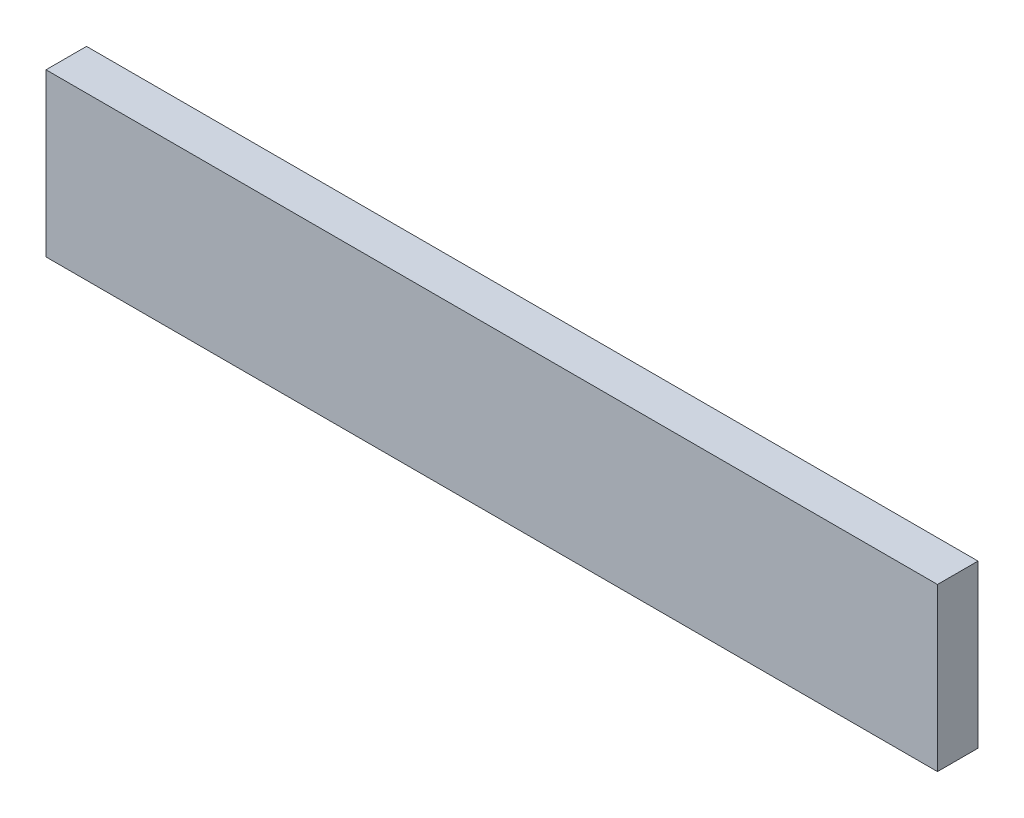
ISO-10303-21;
HEADER;
FILE_DESCRIPTION(('STEP AP214'),'2;1');
FILE_NAME('part.step','',(''),(''),'','','');
FILE_SCHEMA(('AUTOMOTIVE_DESIGN { 1 0 10303 214 1 1 1 1 }'));
ENDSEC;
DATA;
#1=APPLICATION_CONTEXT('core data for automotive mechanical design processes');
#2=APPLICATION_PROTOCOL_DEFINITION('international standard','automotive_design',2000,#1);
#3=PRODUCT_CONTEXT('',#1,'mechanical');
#4=PRODUCT('Part','Part','',(#3));
#5=PRODUCT_RELATED_PRODUCT_CATEGORY('part','',(#4));
#6=PRODUCT_DEFINITION_FORMATION('','',#4);
#7=PRODUCT_DEFINITION_CONTEXT('part definition',#1,'design');
#8=PRODUCT_DEFINITION('design','',#6,#7);
#9=PRODUCT_DEFINITION_SHAPE('','',#8);
#10=(LENGTH_UNIT() NAMED_UNIT(*) SI_UNIT(.MILLI.,.METRE.));
#11=(NAMED_UNIT(*) PLANE_ANGLE_UNIT() SI_UNIT($,.RADIAN.));
#12=(NAMED_UNIT(*) SI_UNIT($,.STERADIAN.) SOLID_ANGLE_UNIT());
#13=UNCERTAINTY_MEASURE_WITH_UNIT(LENGTH_MEASURE(1.E-05),#10,'distance_accuracy_value','');
#14=(GEOMETRIC_REPRESENTATION_CONTEXT(3) GLOBAL_UNCERTAINTY_ASSIGNED_CONTEXT((#13)) GLOBAL_UNIT_ASSIGNED_CONTEXT((#10,
#11,#12)) REPRESENTATION_CONTEXT('',''));
#15=CARTESIAN_POINT('',(0.,0.,0.));
#16=DIRECTION('',(0.,0.,1.));
#17=DIRECTION('',(1.,0.,0.));
#18=AXIS2_PLACEMENT_3D('',#15,#16,#17);
#19=CARTESIAN_POINT('',(0.,0.,3.175));
#20=DIRECTION('',(1.,0.,0.));
#21=DIRECTION('',(0.,0.,-1.));
#22=AXIS2_PLACEMENT_3D('',#19,#20,#21);
#23=PLANE('',#22);
#24=DIRECTION('',(0.,-1.,0.));
#25=VECTOR('',#24,1.);
#26=CARTESIAN_POINT('',(0.,0.,0.));
#27=LINE('',#26,#25);
#28=CARTESIAN_POINT('',(0.,12.7,0.));
#29=VERTEX_POINT('',#28);
#30=CARTESIAN_POINT('',(0.,0.,0.));
#31=VERTEX_POINT('',#30);
#32=EDGE_CURVE('E98',#29,#31,#27,.T.);
#33=ORIENTED_EDGE('',*,*,#32,.T.);
#34=DIRECTION('',(0.,0.,-1.));
#35=VECTOR('',#34,1.);
#36=CARTESIAN_POINT('',(0.,0.,3.175));
#37=LINE('',#36,#35);
#38=CARTESIAN_POINT('',(0.,0.,3.175));
#39=VERTEX_POINT('',#38);
#40=EDGE_CURVE('E11',#39,#31,#37,.T.);
#41=ORIENTED_EDGE('',*,*,#40,.F.);
#42=DIRECTION('',(0.,-1.,0.));
#43=VECTOR('',#42,1.);
#44=CARTESIAN_POINT('',(0.,0.,3.175));
#45=LINE('',#44,#43);
#46=CARTESIAN_POINT('',(0.,12.7,3.175));
#47=VERTEX_POINT('',#46);
#48=EDGE_CURVE('E86',#47,#39,#45,.T.);
#49=ORIENTED_EDGE('',*,*,#48,.F.);
#50=DIRECTION('',(0.,0.,-1.));
#51=VECTOR('',#50,1.);
#52=CARTESIAN_POINT('',(0.,12.7,3.175));
#53=LINE('',#52,#51);
#54=EDGE_CURVE('E94',#47,#29,#53,.T.);
#55=ORIENTED_EDGE('',*,*,#54,.T.);
#56=EDGE_LOOP('',(#33,#41,#49,#55));
#57=FACE_BOUND('',#56,.T.);
#58=ADVANCED_FACE('F35',(#57),#23,.F.);
#59=CARTESIAN_POINT('',(0.,0.,3.175));
#60=DIRECTION('',(0.,1.,0.));
#61=DIRECTION('',(0.,0.,1.));
#62=AXIS2_PLACEMENT_3D('',#59,#60,#61);
#63=PLANE('',#62);
#64=DIRECTION('',(1.,0.,0.));
#65=VECTOR('',#64,1.);
#66=CARTESIAN_POINT('',(0.,0.,0.));
#67=LINE('',#66,#65);
#68=CARTESIAN_POINT('',(69.85,0.,0.));
#69=VERTEX_POINT('',#68);
#70=EDGE_CURVE('E90',#31,#69,#67,.T.);
#71=ORIENTED_EDGE('',*,*,#70,.T.);
#72=DIRECTION('',(0.,0.,-1.));
#73=VECTOR('',#72,1.);
#74=CARTESIAN_POINT('',(69.85,0.,3.175));
#75=LINE('',#74,#73);
#76=CARTESIAN_POINT('',(69.85,0.,3.175));
#77=VERTEX_POINT('',#76);
#78=EDGE_CURVE('E43',#77,#69,#75,.T.);
#79=ORIENTED_EDGE('',*,*,#78,.F.);
#80=DIRECTION('',(1.,0.,0.));
#81=VECTOR('',#80,1.);
#82=CARTESIAN_POINT('',(0.,0.,3.175));
#83=LINE('',#82,#81);
#84=EDGE_CURVE('E81',#39,#77,#83,.T.);
#85=ORIENTED_EDGE('',*,*,#84,.F.);
#86=ORIENTED_EDGE('',*,*,#40,.T.);
#87=EDGE_LOOP('',(#71,#79,#85,#86));
#88=FACE_BOUND('',#87,.T.);
#89=ADVANCED_FACE('F89',(#88),#63,.F.);
#90=CARTESIAN_POINT('',(69.85,0.,3.175));
#91=DIRECTION('',(-1.,0.,0.));
#92=DIRECTION('',(0.,0.,1.));
#93=AXIS2_PLACEMENT_3D('',#90,#91,#92);
#94=PLANE('',#93);
#95=DIRECTION('',(0.,1.,0.));
#96=VECTOR('',#95,1.);
#97=CARTESIAN_POINT('',(69.85,0.,0.));
#98=LINE('',#97,#96);
#99=CARTESIAN_POINT('',(69.85,12.7,0.));
#100=VERTEX_POINT('',#99);
#101=EDGE_CURVE('E68',#69,#100,#98,.T.);
#102=ORIENTED_EDGE('',*,*,#101,.T.);
#103=DIRECTION('',(0.,0.,-1.));
#104=VECTOR('',#103,1.);
#105=CARTESIAN_POINT('',(69.85,12.7,3.175));
#106=LINE('',#105,#104);
#107=CARTESIAN_POINT('',(69.85,12.7,3.175));
#108=VERTEX_POINT('',#107);
#109=EDGE_CURVE('E91',#108,#100,#106,.T.);
#110=ORIENTED_EDGE('',*,*,#109,.F.);
#111=DIRECTION('',(0.,1.,0.));
#112=VECTOR('',#111,1.);
#113=CARTESIAN_POINT('',(69.85,0.,3.175));
#114=LINE('',#113,#112);
#115=EDGE_CURVE('E84',#77,#108,#114,.T.);
#116=ORIENTED_EDGE('',*,*,#115,.F.);
#117=ORIENTED_EDGE('',*,*,#78,.T.);
#118=EDGE_LOOP('',(#102,#110,#116,#117));
#119=FACE_BOUND('',#118,.T.);
#120=ADVANCED_FACE('F92',(#119),#94,.F.);
#121=CARTESIAN_POINT('',(0.,12.7,3.175));
#122=DIRECTION('',(0.,-1.,0.));
#123=DIRECTION('',(0.,0.,-1.));
#124=AXIS2_PLACEMENT_3D('',#121,#122,#123);
#125=PLANE('',#124);
#126=DIRECTION('',(-1.,0.,0.));
#127=VECTOR('',#126,1.);
#128=CARTESIAN_POINT('',(0.,12.7,0.));
#129=LINE('',#128,#127);
#130=EDGE_CURVE('E74',#100,#29,#129,.T.);
#131=ORIENTED_EDGE('',*,*,#130,.T.);
#132=ORIENTED_EDGE('',*,*,#54,.F.);
#133=DIRECTION('',(-1.,0.,0.));
#134=VECTOR('',#133,1.);
#135=CARTESIAN_POINT('',(0.,12.7,3.175));
#136=LINE('',#135,#134);
#137=EDGE_CURVE('E51',#108,#47,#136,.T.);
#138=ORIENTED_EDGE('',*,*,#137,.F.);
#139=ORIENTED_EDGE('',*,*,#109,.T.);
#140=EDGE_LOOP('',(#131,#132,#138,#139));
#141=FACE_BOUND('',#140,.T.);
#142=ADVANCED_FACE('F105',(#141),#125,.F.);
#143=CARTESIAN_POINT('',(0.,0.,3.175));
#144=DIRECTION('',(0.,0.,-1.));
#145=DIRECTION('',(-1.,0.,0.));
#146=AXIS2_PLACEMENT_3D('',#143,#144,#145);
#147=PLANE('',#146);
#148=ORIENTED_EDGE('',*,*,#48,.T.);
#149=ORIENTED_EDGE('',*,*,#84,.T.);
#150=ORIENTED_EDGE('',*,*,#115,.T.);
#151=ORIENTED_EDGE('',*,*,#137,.T.);
#152=EDGE_LOOP('',(#148,#149,#150,#151));
#153=FACE_BOUND('',#152,.T.);
#154=ADVANCED_FACE('F82',(#153),#147,.F.);
#155=CARTESIAN_POINT('',(0.,0.,0.));
#156=DIRECTION('',(0.,0.,-1.));
#157=DIRECTION('',(-1.,0.,0.));
#158=AXIS2_PLACEMENT_3D('',#155,#156,#157);
#159=PLANE('',#158);
#160=ORIENTED_EDGE('',*,*,#32,.F.);
#161=ORIENTED_EDGE('',*,*,#130,.F.);
#162=ORIENTED_EDGE('',*,*,#101,.F.);
#163=ORIENTED_EDGE('',*,*,#70,.F.);
#164=EDGE_LOOP('',(#160,#161,#162,#163));
#165=FACE_BOUND('',#164,.T.);
#166=ADVANCED_FACE('F108',(#165),#159,.T.);
#167=CLOSED_SHELL('',(#58,#89,#120,#142,#154,#166));
#168=MANIFOLD_SOLID_BREP('B2',#167);
#169=ADVANCED_BREP_SHAPE_REPRESENTATION('',(#18,#168),#14);
#170=SHAPE_DEFINITION_REPRESENTATION(#9,#169);
ENDSEC;
END-ISO-10303-21;
